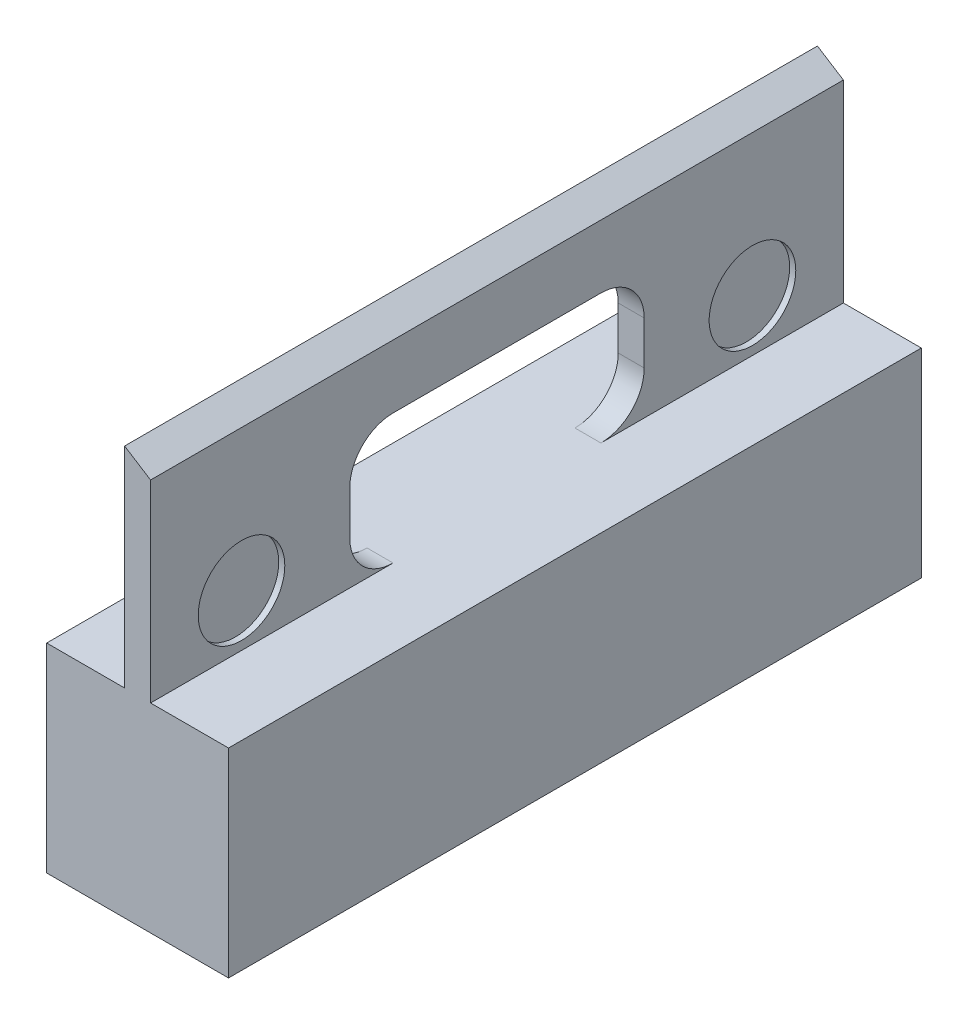
ISO-10303-21;
HEADER;
FILE_DESCRIPTION(('STEP AP214'),'2;1');
FILE_NAME('part.step','',(''),(''),'','','');
FILE_SCHEMA(('AUTOMOTIVE_DESIGN { 1 0 10303 214 1 1 1 1 }'));
ENDSEC;
DATA;
#1=APPLICATION_CONTEXT('core data for automotive mechanical design processes');
#2=APPLICATION_PROTOCOL_DEFINITION('international standard','automotive_design',2000,#1);
#3=PRODUCT_CONTEXT('',#1,'mechanical');
#4=PRODUCT('Part','Part','',(#3));
#5=PRODUCT_RELATED_PRODUCT_CATEGORY('part','',(#4));
#6=PRODUCT_DEFINITION_FORMATION('','',#4);
#7=PRODUCT_DEFINITION_CONTEXT('part definition',#1,'design');
#8=PRODUCT_DEFINITION('design','',#6,#7);
#9=PRODUCT_DEFINITION_SHAPE('','',#8);
#10=(LENGTH_UNIT() NAMED_UNIT(*) SI_UNIT(.MILLI.,.METRE.));
#11=(NAMED_UNIT(*) PLANE_ANGLE_UNIT() SI_UNIT($,.RADIAN.));
#12=(NAMED_UNIT(*) SI_UNIT($,.STERADIAN.) SOLID_ANGLE_UNIT());
#13=UNCERTAINTY_MEASURE_WITH_UNIT(LENGTH_MEASURE(1.E-05),#10,'distance_accuracy_value','');
#14=(GEOMETRIC_REPRESENTATION_CONTEXT(3) GLOBAL_UNCERTAINTY_ASSIGNED_CONTEXT((#13)) GLOBAL_UNIT_ASSIGNED_CONTEXT((#10,
#11,#12)) REPRESENTATION_CONTEXT('',''));
#15=CARTESIAN_POINT('',(0.,0.,0.));
#16=DIRECTION('',(0.,0.,1.));
#17=DIRECTION('',(1.,0.,0.));
#18=AXIS2_PLACEMENT_3D('',#15,#16,#17);
#19=CARTESIAN_POINT('',(0.,-21.,0.));
#20=DIRECTION('',(0.,-1.,0.));
#21=DIRECTION('',(0.,0.,-1.));
#22=AXIS2_PLACEMENT_3D('',#19,#20,#21);
#23=PLANE('',#22);
#24=DIRECTION('',(-1.,0.,0.));
#25=VECTOR('',#24,1.);
#26=CARTESIAN_POINT('',(-19.,-21.,48.));
#27=LINE('',#26,#25);
#28=CARTESIAN_POINT('',(-19.,-21.,48.));
#29=VERTEX_POINT('',#28);
#30=CARTESIAN_POINT('',(-21.,-21.,48.));
#31=VERTEX_POINT('',#30);
#32=EDGE_CURVE('E229',#29,#31,#27,.T.);
#33=ORIENTED_EDGE('',*,*,#32,.F.);
#34=DIRECTION('',(0.,0.,1.));
#35=VECTOR('',#34,1.);
#36=CARTESIAN_POINT('',(-19.,-21.,0.));
#37=LINE('',#36,#35);
#38=CARTESIAN_POINT('',(-19.,-21.,78.));
#39=VERTEX_POINT('',#38);
#40=EDGE_CURVE('E216',#29,#39,#37,.T.);
#41=ORIENTED_EDGE('',*,*,#40,.T.);
#42=DIRECTION('',(1.,0.,0.));
#43=VECTOR('',#42,1.);
#44=CARTESIAN_POINT('',(0.,-21.,78.));
#45=LINE('',#44,#43);
#46=CARTESIAN_POINT('',(-1.99999999999999,-21.,78.));
#47=VERTEX_POINT('',#46);
#48=EDGE_CURVE('E249',#39,#47,#45,.T.);
#49=ORIENTED_EDGE('',*,*,#48,.T.);
#50=DIRECTION('',(0.,0.,-1.));
#51=VECTOR('',#50,1.);
#52=CARTESIAN_POINT('',(-2.,-21.,0.));
#53=LINE('',#52,#51);
#54=CARTESIAN_POINT('',(-2.,-21.,2.));
#55=VERTEX_POINT('',#54);
#56=EDGE_CURVE('E242',#47,#55,#53,.T.);
#57=ORIENTED_EDGE('',*,*,#56,.T.);
#58=DIRECTION('',(-1.,0.,0.));
#59=VECTOR('',#58,1.);
#60=CARTESIAN_POINT('',(0.,-21.,2.));
#61=LINE('',#60,#59);
#62=CARTESIAN_POINT('',(-19.,-21.,2.));
#63=VERTEX_POINT('',#62);
#64=EDGE_CURVE('E259',#55,#63,#61,.T.);
#65=ORIENTED_EDGE('',*,*,#64,.T.);
#66=CARTESIAN_POINT('',(-19.,-21.,32.));
#67=VERTEX_POINT('',#66);
#68=EDGE_CURVE('E58',#63,#67,#37,.T.);
#69=ORIENTED_EDGE('',*,*,#68,.T.);
#70=DIRECTION('',(-1.,0.,0.));
#71=VECTOR('',#70,1.);
#72=CARTESIAN_POINT('',(-19.,-21.,32.));
#73=LINE('',#72,#71);
#74=CARTESIAN_POINT('',(-21.,-21.,32.));
#75=VERTEX_POINT('',#74);
#76=EDGE_CURVE('E232',#67,#75,#73,.T.);
#77=ORIENTED_EDGE('',*,*,#76,.T.);
#78=DIRECTION('',(0.,0.,1.));
#79=VECTOR('',#78,1.);
#80=CARTESIAN_POINT('',(-21.,-21.,0.));
#81=LINE('',#80,#79);
#82=CARTESIAN_POINT('',(-21.,-21.,0.));
#83=VERTEX_POINT('',#82);
#84=EDGE_CURVE('E328',#83,#75,#81,.T.);
#85=ORIENTED_EDGE('',*,*,#84,.F.);
#86=DIRECTION('',(-1.,0.,0.));
#87=VECTOR('',#86,1.);
#88=CARTESIAN_POINT('',(0.,-21.,0.));
#89=LINE('',#88,#87);
#90=CARTESIAN_POINT('',(0.,-21.,0.));
#91=VERTEX_POINT('',#90);
#92=EDGE_CURVE('E324',#91,#83,#89,.T.);
#93=ORIENTED_EDGE('',*,*,#92,.F.);
#94=DIRECTION('',(0.,0.,-1.));
#95=VECTOR('',#94,1.);
#96=CARTESIAN_POINT('',(0.,-21.,0.));
#97=LINE('',#96,#95);
#98=CARTESIAN_POINT('',(0.,-21.,80.));
#99=VERTEX_POINT('',#98);
#100=EDGE_CURVE('E321',#99,#91,#97,.T.);
#101=ORIENTED_EDGE('',*,*,#100,.F.);
#102=DIRECTION('',(1.,0.,0.));
#103=VECTOR('',#102,1.);
#104=CARTESIAN_POINT('',(0.,-21.,80.));
#105=LINE('',#104,#103);
#106=CARTESIAN_POINT('',(-21.,-21.,80.));
#107=VERTEX_POINT('',#106);
#108=EDGE_CURVE('E331',#107,#99,#105,.T.);
#109=ORIENTED_EDGE('',*,*,#108,.F.);
#110=EDGE_CURVE('E327',#31,#107,#81,.T.);
#111=ORIENTED_EDGE('',*,*,#110,.F.);
#112=EDGE_LOOP('',(#33,#41,#49,#57,#65,#69,#77,#85,#93,#101,#109,#111));
#113=FACE_BOUND('',#112,.T.);
#114=ADVANCED_FACE('F36',(#113),#23,.T.);
#115=CARTESIAN_POINT('',(0.,2.,0.));
#116=DIRECTION('',(0.,-1.,0.));
#117=DIRECTION('',(0.,0.,-1.));
#118=AXIS2_PLACEMENT_3D('',#115,#116,#117);
#119=PLANE('',#118);
#120=DIRECTION('',(-1.,0.,0.));
#121=VECTOR('',#120,1.);
#122=CARTESIAN_POINT('',(-12.,2.,28.));
#123=LINE('',#122,#121);
#124=CARTESIAN_POINT('',(-8.99999999999999,2.,28.));
#125=VERTEX_POINT('',#124);
#126=CARTESIAN_POINT('',(-12.,2.,28.));
#127=VERTEX_POINT('',#126);
#128=EDGE_CURVE('E347',#125,#127,#123,.T.);
#129=ORIENTED_EDGE('',*,*,#128,.T.);
#130=DIRECTION('',(0.,0.,1.));
#131=VECTOR('',#130,1.);
#132=CARTESIAN_POINT('',(-12.,2.,0.));
#133=LINE('',#132,#131);
#134=CARTESIAN_POINT('',(-12.,2.,0.));
#135=VERTEX_POINT('',#134);
#136=EDGE_CURVE('E293',#135,#127,#133,.T.);
#137=ORIENTED_EDGE('',*,*,#136,.F.);
#138=DIRECTION('',(-1.,0.,0.));
#139=VECTOR('',#138,1.);
#140=CARTESIAN_POINT('',(0.,2.,0.));
#141=LINE('',#140,#139);
#142=CARTESIAN_POINT('',(-21.,2.,0.));
#143=VERTEX_POINT('',#142);
#144=EDGE_CURVE('E310',#135,#143,#141,.T.);
#145=ORIENTED_EDGE('',*,*,#144,.T.);
#146=DIRECTION('',(0.,0.,1.));
#147=VECTOR('',#146,1.);
#148=CARTESIAN_POINT('',(-21.,2.,0.));
#149=LINE('',#148,#147);
#150=CARTESIAN_POINT('',(-21.,2.,80.));
#151=VERTEX_POINT('',#150);
#152=EDGE_CURVE('E314',#143,#151,#149,.T.);
#153=ORIENTED_EDGE('',*,*,#152,.T.);
#154=DIRECTION('',(1.,0.,0.));
#155=VECTOR('',#154,1.);
#156=CARTESIAN_POINT('',(0.,2.,80.));
#157=LINE('',#156,#155);
#158=CARTESIAN_POINT('',(-12.,2.,80.));
#159=VERTEX_POINT('',#158);
#160=EDGE_CURVE('E318',#151,#159,#157,.T.);
#161=ORIENTED_EDGE('',*,*,#160,.T.);
#162=CARTESIAN_POINT('',(-12.,2.,52.));
#163=VERTEX_POINT('',#162);
#164=EDGE_CURVE('E296',#163,#159,#133,.T.);
#165=ORIENTED_EDGE('',*,*,#164,.F.);
#166=DIRECTION('',(-1.,0.,0.));
#167=VECTOR('',#166,1.);
#168=CARTESIAN_POINT('',(-8.99999999999999,2.,52.));
#169=LINE('',#168,#167);
#170=CARTESIAN_POINT('',(-8.99999999999998,2.,52.));
#171=VERTEX_POINT('',#170);
#172=EDGE_CURVE('E338',#163,#171,#169,.F.);
#173=ORIENTED_EDGE('',*,*,#172,.T.);
#174=DIRECTION('',(0.,0.,-1.));
#175=VECTOR('',#174,1.);
#176=CARTESIAN_POINT('',(-8.99999999999999,2.,0.));
#177=LINE('',#176,#175);
#178=CARTESIAN_POINT('',(-8.99999999999998,2.,80.));
#179=VERTEX_POINT('',#178);
#180=EDGE_CURVE('E294',#179,#171,#177,.T.);
#181=ORIENTED_EDGE('',*,*,#180,.F.);
#182=CARTESIAN_POINT('',(0.,2.,80.));
#183=VERTEX_POINT('',#182);
#184=EDGE_CURVE('E317',#179,#183,#157,.T.);
#185=ORIENTED_EDGE('',*,*,#184,.T.);
#186=DIRECTION('',(0.,0.,-1.));
#187=VECTOR('',#186,1.);
#188=CARTESIAN_POINT('',(0.,2.,0.));
#189=LINE('',#188,#187);
#190=CARTESIAN_POINT('',(0.,2.,0.));
#191=VERTEX_POINT('',#190);
#192=EDGE_CURVE('E307',#183,#191,#189,.T.);
#193=ORIENTED_EDGE('',*,*,#192,.T.);
#194=CARTESIAN_POINT('',(-8.99999999999998,2.,0.));
#195=VERTEX_POINT('',#194);
#196=EDGE_CURVE('E311',#191,#195,#141,.T.);
#197=ORIENTED_EDGE('',*,*,#196,.T.);
#198=EDGE_CURVE('E282',#125,#195,#177,.T.);
#199=ORIENTED_EDGE('',*,*,#198,.F.);
#200=EDGE_LOOP('',(#129,#137,#145,#153,#161,#165,#173,#181,#185,#193,#197,#199));
#201=FACE_BOUND('',#200,.T.);
#202=ADVANCED_FACE('F389',(#201),#119,.F.);
#203=CARTESIAN_POINT('',(0.,-21.,0.));
#204=DIRECTION('',(1.,0.,0.));
#205=DIRECTION('',(0.,0.,-1.));
#206=AXIS2_PLACEMENT_3D('',#203,#204,#205);
#207=PLANE('',#206);
#208=DIRECTION('',(0.,1.,0.));
#209=VECTOR('',#208,1.);
#210=CARTESIAN_POINT('',(0.,-21.,0.));
#211=LINE('',#210,#209);
#212=EDGE_CURVE('E334',#91,#191,#211,.T.);
#213=ORIENTED_EDGE('',*,*,#212,.T.);
#214=ORIENTED_EDGE('',*,*,#192,.F.);
#215=DIRECTION('',(0.,1.,0.));
#216=VECTOR('',#215,1.);
#217=CARTESIAN_POINT('',(0.,-21.,80.));
#218=LINE('',#217,#216);
#219=EDGE_CURVE('E335',#99,#183,#218,.T.);
#220=ORIENTED_EDGE('',*,*,#219,.F.);
#221=ORIENTED_EDGE('',*,*,#100,.T.);
#222=EDGE_LOOP('',(#213,#214,#220,#221));
#223=FACE_BOUND('',#222,.T.);
#224=ADVANCED_FACE('F439',(#223),#207,.T.);
#225=CARTESIAN_POINT('',(0.,-21.,80.));
#226=DIRECTION('',(0.,0.,1.));
#227=DIRECTION('',(1.,0.,0.));
#228=AXIS2_PLACEMENT_3D('',#225,#226,#227);
#229=PLANE('',#228);
#230=DIRECTION('',(0.844819075554229,-0.535052081184344,0.));
#231=VECTOR('',#230,1.);
#232=CARTESIAN_POINT('',(-8.99999999999998,24.3,80.));
#233=LINE('',#232,#231);
#234=CARTESIAN_POINT('',(-12.,26.2,80.));
#235=VERTEX_POINT('',#234);
#236=CARTESIAN_POINT('',(-8.99999999999998,24.3,80.));
#237=VERTEX_POINT('',#236);
#238=EDGE_CURVE('E253',#235,#237,#233,.T.);
#239=ORIENTED_EDGE('',*,*,#238,.F.);
#240=DIRECTION('',(0.,-1.,0.));
#241=VECTOR('',#240,1.);
#242=CARTESIAN_POINT('',(-12.,26.2,80.));
#243=LINE('',#242,#241);
#244=EDGE_CURVE('E299',#235,#159,#243,.T.);
#245=ORIENTED_EDGE('',*,*,#244,.T.);
#246=ORIENTED_EDGE('',*,*,#160,.F.);
#247=DIRECTION('',(0.,1.,0.));
#248=VECTOR('',#247,1.);
#249=CARTESIAN_POINT('',(-21.,-21.,80.));
#250=LINE('',#249,#248);
#251=EDGE_CURVE('E339',#107,#151,#250,.T.);
#252=ORIENTED_EDGE('',*,*,#251,.F.);
#253=ORIENTED_EDGE('',*,*,#108,.T.);
#254=ORIENTED_EDGE('',*,*,#219,.T.);
#255=ORIENTED_EDGE('',*,*,#184,.F.);
#256=DIRECTION('',(0.,-1.,0.));
#257=VECTOR('',#256,1.);
#258=CARTESIAN_POINT('',(-8.99999999999998,26.2,80.));
#259=LINE('',#258,#257);
#260=EDGE_CURVE('E292',#237,#179,#259,.T.);
#261=ORIENTED_EDGE('',*,*,#260,.F.);
#262=EDGE_LOOP('',(#239,#245,#246,#252,#253,#254,#255,#261));
#263=FACE_BOUND('',#262,.T.);
#264=ADVANCED_FACE('F396',(#263),#229,.T.);
#265=CARTESIAN_POINT('',(-21.,-21.,0.));
#266=DIRECTION('',(-1.,0.,0.));
#267=DIRECTION('',(0.,0.,1.));
#268=AXIS2_PLACEMENT_3D('',#265,#266,#267);
#269=PLANE('',#268);
#270=DIRECTION('',(0.,1.,0.));
#271=VECTOR('',#270,1.);
#272=CARTESIAN_POINT('',(-21.,-21.,48.));
#273=LINE('',#272,#271);
#274=CARTESIAN_POINT('',(-21.,-11.,48.));
#275=VERTEX_POINT('',#274);
#276=EDGE_CURVE('E203',#31,#275,#273,.T.);
#277=ORIENTED_EDGE('',*,*,#276,.F.);
#278=ORIENTED_EDGE('',*,*,#110,.T.);
#279=ORIENTED_EDGE('',*,*,#251,.T.);
#280=ORIENTED_EDGE('',*,*,#152,.F.);
#281=DIRECTION('',(0.,1.,0.));
#282=VECTOR('',#281,1.);
#283=CARTESIAN_POINT('',(-21.,-21.,0.));
#284=LINE('',#283,#282);
#285=EDGE_CURVE('E341',#83,#143,#284,.T.);
#286=ORIENTED_EDGE('',*,*,#285,.F.);
#287=ORIENTED_EDGE('',*,*,#84,.T.);
#288=DIRECTION('',(0.,-1.,0.));
#289=VECTOR('',#288,1.);
#290=CARTESIAN_POINT('',(-21.,-21.,32.));
#291=LINE('',#290,#289);
#292=CARTESIAN_POINT('',(-21.,-11.,32.));
#293=VERTEX_POINT('',#292);
#294=EDGE_CURVE('E217',#293,#75,#291,.T.);
#295=ORIENTED_EDGE('',*,*,#294,.F.);
#296=DIRECTION('',(0.,0.,-1.));
#297=VECTOR('',#296,1.);
#298=CARTESIAN_POINT('',(-21.,-11.,48.));
#299=LINE('',#298,#297);
#300=EDGE_CURVE('E219',#275,#293,#299,.T.);
#301=ORIENTED_EDGE('',*,*,#300,.F.);
#302=EDGE_LOOP('',(#277,#278,#279,#280,#286,#287,#295,#301));
#303=FACE_BOUND('',#302,.T.);
#304=ADVANCED_FACE('F447',(#303),#269,.T.);
#305=CARTESIAN_POINT('',(0.,-21.,0.));
#306=DIRECTION('',(0.,0.,-1.));
#307=DIRECTION('',(-1.,0.,0.));
#308=AXIS2_PLACEMENT_3D('',#305,#306,#307);
#309=PLANE('',#308);
#310=DIRECTION('',(-0.844819075554229,0.535052081184344,0.));
#311=VECTOR('',#310,1.);
#312=CARTESIAN_POINT('',(17.9000793021412,7.26328310864396,0.));
#313=LINE('',#312,#311);
#314=CARTESIAN_POINT('',(-8.99999999999998,24.3,0.));
#315=VERTEX_POINT('',#314);
#316=CARTESIAN_POINT('',(-12.,26.2,0.));
#317=VERTEX_POINT('',#316);
#318=EDGE_CURVE('E269',#315,#317,#313,.T.);
#319=ORIENTED_EDGE('',*,*,#318,.F.);
#320=DIRECTION('',(0.,-1.,0.));
#321=VECTOR('',#320,1.);
#322=CARTESIAN_POINT('',(-8.99999999999999,26.2,0.));
#323=LINE('',#322,#321);
#324=EDGE_CURVE('E305',#315,#195,#323,.T.);
#325=ORIENTED_EDGE('',*,*,#324,.T.);
#326=ORIENTED_EDGE('',*,*,#196,.F.);
#327=ORIENTED_EDGE('',*,*,#212,.F.);
#328=ORIENTED_EDGE('',*,*,#92,.T.);
#329=ORIENTED_EDGE('',*,*,#285,.T.);
#330=ORIENTED_EDGE('',*,*,#144,.F.);
#331=DIRECTION('',(0.,-1.,0.));
#332=VECTOR('',#331,1.);
#333=CARTESIAN_POINT('',(-12.,26.2,0.));
#334=LINE('',#333,#332);
#335=EDGE_CURVE('E302',#317,#135,#334,.T.);
#336=ORIENTED_EDGE('',*,*,#335,.F.);
#337=EDGE_LOOP('',(#319,#325,#326,#327,#328,#329,#330,#336));
#338=FACE_BOUND('',#337,.T.);
#339=ADVANCED_FACE('F406',(#338),#309,.T.);
#340=CARTESIAN_POINT('',(-8.99999999999999,26.2,0.));
#341=DIRECTION('',(-1.,0.,0.));
#342=DIRECTION('',(0.,0.,1.));
#343=AXIS2_PLACEMENT_3D('',#340,#341,#342);
#344=PLANE('',#343);
#345=CARTESIAN_POINT('',(-8.99999999999998,8.,69.5));
#346=DIRECTION('',(1.,0.,0.));
#347=DIRECTION('',(0.,0.,-1.));
#348=AXIS2_PLACEMENT_3D('',#345,#346,#347);
#349=CIRCLE('',#348,5.);
#350=CARTESIAN_POINT('',(-8.99999999999998,8.,64.5));
#351=VERTEX_POINT('',#350);
#352=EDGE_CURVE('E758',#351,#351,#349,.T.);
#353=ORIENTED_EDGE('',*,*,#352,.F.);
#354=EDGE_LOOP('',(#353));
#355=FACE_BOUND('',#354,.T.);
#356=CARTESIAN_POINT('',(-8.99999999999999,8.,10.5));
#357=DIRECTION('',(1.,0.,0.));
#358=DIRECTION('',(0.,0.,-1.));
#359=AXIS2_PLACEMENT_3D('',#356,#357,#358);
#360=CIRCLE('',#359,5.);
#361=CARTESIAN_POINT('',(-8.99999999999999,8.,5.5));
#362=VERTEX_POINT('',#361);
#363=EDGE_CURVE('E222',#362,#362,#360,.T.);
#364=ORIENTED_EDGE('',*,*,#363,.F.);
#365=EDGE_LOOP('',(#364));
#366=FACE_BOUND('',#365,.T.);
#367=ORIENTED_EDGE('',*,*,#324,.F.);
#368=DIRECTION('',(0.,0.,1.));
#369=VECTOR('',#368,1.);
#370=CARTESIAN_POINT('',(-8.99999999999998,24.3,-1.00000000000004));
#371=LINE('',#370,#369);
#372=EDGE_CURVE('E266',#315,#237,#371,.T.);
#373=ORIENTED_EDGE('',*,*,#372,.T.);
#374=ORIENTED_EDGE('',*,*,#260,.T.);
#375=ORIENTED_EDGE('',*,*,#180,.T.);
#376=CARTESIAN_POINT('',(-8.99999999999998,7.,52.));
#377=DIRECTION('',(-1.,0.,0.));
#378=DIRECTION('',(0.,0.,1.));
#379=AXIS2_PLACEMENT_3D('',#376,#377,#378);
#380=CIRCLE('',#379,5.);
#381=CARTESIAN_POINT('',(-8.99999999999999,7.,57.));
#382=VERTEX_POINT('',#381);
#383=EDGE_CURVE('E11',#171,#382,#380,.T.);
#384=ORIENTED_EDGE('',*,*,#383,.T.);
#385=DIRECTION('',(0.,1.,0.));
#386=VECTOR('',#385,1.);
#387=CARTESIAN_POINT('',(-8.99999999999999,2.,57.));
#388=LINE('',#387,#386);
#389=CARTESIAN_POINT('',(-8.99999999999999,12.,57.));
#390=VERTEX_POINT('',#389);
#391=EDGE_CURVE('E272',#382,#390,#388,.T.);
#392=ORIENTED_EDGE('',*,*,#391,.T.);
#393=CARTESIAN_POINT('',(-8.99999999999998,12.,52.));
#394=DIRECTION('',(-1.,0.,0.));
#395=DIRECTION('',(0.,0.,1.));
#396=AXIS2_PLACEMENT_3D('',#393,#394,#395);
#397=CIRCLE('',#396,5.);
#398=CARTESIAN_POINT('',(-8.99999999999999,17.,52.));
#399=VERTEX_POINT('',#398);
#400=EDGE_CURVE('E376',#390,#399,#397,.T.);
#401=ORIENTED_EDGE('',*,*,#400,.T.);
#402=DIRECTION('',(0.,0.,-1.));
#403=VECTOR('',#402,1.);
#404=CARTESIAN_POINT('',(-8.99999999999999,17.,57.));
#405=LINE('',#404,#403);
#406=CARTESIAN_POINT('',(-8.99999999999999,17.,28.));
#407=VERTEX_POINT('',#406);
#408=EDGE_CURVE('E275',#399,#407,#405,.T.);
#409=ORIENTED_EDGE('',*,*,#408,.T.);
#410=CARTESIAN_POINT('',(-8.99999999999999,12.,28.));
#411=DIRECTION('',(-1.,0.,0.));
#412=DIRECTION('',(0.,0.,1.));
#413=AXIS2_PLACEMENT_3D('',#410,#411,#412);
#414=CIRCLE('',#413,5.);
#415=CARTESIAN_POINT('',(-8.99999999999999,12.,23.));
#416=VERTEX_POINT('',#415);
#417=EDGE_CURVE('E372',#407,#416,#414,.T.);
#418=ORIENTED_EDGE('',*,*,#417,.T.);
#419=DIRECTION('',(0.,-1.,0.));
#420=VECTOR('',#419,1.);
#421=CARTESIAN_POINT('',(-8.99999999999999,2.,23.));
#422=LINE('',#421,#420);
#423=CARTESIAN_POINT('',(-8.99999999999999,7.,23.));
#424=VERTEX_POINT('',#423);
#425=EDGE_CURVE('E279',#416,#424,#422,.T.);
#426=ORIENTED_EDGE('',*,*,#425,.T.);
#427=CARTESIAN_POINT('',(-8.99999999999999,7.,28.));
#428=DIRECTION('',(-1.,0.,0.));
#429=DIRECTION('',(0.,0.,1.));
#430=AXIS2_PLACEMENT_3D('',#427,#428,#429);
#431=CIRCLE('',#430,5.);
#432=EDGE_CURVE('E367',#424,#125,#431,.T.);
#433=ORIENTED_EDGE('',*,*,#432,.T.);
#434=ORIENTED_EDGE('',*,*,#198,.T.);
#435=EDGE_LOOP('',(#367,#373,#374,#375,#384,#392,#401,#409,#418,#426,#433,#434));
#436=FACE_BOUND('',#435,.T.);
#437=ADVANCED_FACE('F419',(#355,#366,#436),#344,.F.);
#438=CARTESIAN_POINT('',(-12.,26.2,0.));
#439=DIRECTION('',(1.,0.,0.));
#440=DIRECTION('',(0.,0.,-1.));
#441=AXIS2_PLACEMENT_3D('',#438,#439,#440);
#442=PLANE('',#441);
#443=DIRECTION('',(0.,0.,-1.));
#444=VECTOR('',#443,1.);
#445=CARTESIAN_POINT('',(-12.,17.,57.));
#446=LINE('',#445,#444);
#447=CARTESIAN_POINT('',(-12.,17.,52.));
#448=VERTEX_POINT('',#447);
#449=CARTESIAN_POINT('',(-12.,17.,28.));
#450=VERTEX_POINT('',#449);
#451=EDGE_CURVE('E285',#448,#450,#446,.T.);
#452=ORIENTED_EDGE('',*,*,#451,.F.);
#453=CARTESIAN_POINT('',(-12.,12.,52.));
#454=DIRECTION('',(1.,0.,0.));
#455=DIRECTION('',(0.,0.,-1.));
#456=AXIS2_PLACEMENT_3D('',#453,#454,#455);
#457=CIRCLE('',#456,5.);
#458=CARTESIAN_POINT('',(-12.,12.,57.));
#459=VERTEX_POINT('',#458);
#460=EDGE_CURVE('E374',#448,#459,#457,.T.);
#461=ORIENTED_EDGE('',*,*,#460,.T.);
#462=DIRECTION('',(0.,1.,0.));
#463=VECTOR('',#462,1.);
#464=CARTESIAN_POINT('',(-12.,2.,57.));
#465=LINE('',#464,#463);
#466=CARTESIAN_POINT('',(-12.,7.,57.));
#467=VERTEX_POINT('',#466);
#468=EDGE_CURVE('E271',#467,#459,#465,.T.);
#469=ORIENTED_EDGE('',*,*,#468,.F.);
#470=CARTESIAN_POINT('',(-12.,7.,52.));
#471=DIRECTION('',(1.,0.,0.));
#472=DIRECTION('',(0.,0.,-1.));
#473=AXIS2_PLACEMENT_3D('',#470,#471,#472);
#474=CIRCLE('',#473,5.);
#475=EDGE_CURVE('E44',#467,#163,#474,.T.);
#476=ORIENTED_EDGE('',*,*,#475,.T.);
#477=ORIENTED_EDGE('',*,*,#164,.T.);
#478=ORIENTED_EDGE('',*,*,#244,.F.);
#479=DIRECTION('',(0.,0.,1.));
#480=VECTOR('',#479,1.);
#481=CARTESIAN_POINT('',(-12.,26.2,0.));
#482=LINE('',#481,#480);
#483=EDGE_CURVE('E290',#317,#235,#482,.T.);
#484=ORIENTED_EDGE('',*,*,#483,.F.);
#485=ORIENTED_EDGE('',*,*,#335,.T.);
#486=ORIENTED_EDGE('',*,*,#136,.T.);
#487=CARTESIAN_POINT('',(-12.,7.,28.));
#488=DIRECTION('',(1.,0.,0.));
#489=DIRECTION('',(0.,0.,-1.));
#490=AXIS2_PLACEMENT_3D('',#487,#488,#489);
#491=CIRCLE('',#490,5.);
#492=CARTESIAN_POINT('',(-12.,7.,23.));
#493=VERTEX_POINT('',#492);
#494=EDGE_CURVE('E365',#127,#493,#491,.T.);
#495=ORIENTED_EDGE('',*,*,#494,.T.);
#496=DIRECTION('',(0.,-1.,0.));
#497=VECTOR('',#496,1.);
#498=CARTESIAN_POINT('',(-12.,2.,23.));
#499=LINE('',#498,#497);
#500=CARTESIAN_POINT('',(-12.,12.,23.));
#501=VERTEX_POINT('',#500);
#502=EDGE_CURVE('E276',#501,#493,#499,.T.);
#503=ORIENTED_EDGE('',*,*,#502,.F.);
#504=CARTESIAN_POINT('',(-12.,12.,28.));
#505=DIRECTION('',(1.,0.,0.));
#506=DIRECTION('',(0.,0.,-1.));
#507=AXIS2_PLACEMENT_3D('',#504,#505,#506);
#508=CIRCLE('',#507,5.);
#509=EDGE_CURVE('E370',#501,#450,#508,.T.);
#510=ORIENTED_EDGE('',*,*,#509,.T.);
#511=EDGE_LOOP('',(#452,#461,#469,#476,#477,#478,#484,#485,#486,#495,#503,#510));
#512=FACE_BOUND('',#511,.T.);
#513=ADVANCED_FACE('F382',(#512),#442,.F.);
#514=CARTESIAN_POINT('',(-8.99999999999999,2.,57.));
#515=DIRECTION('',(0.,0.,1.));
#516=DIRECTION('',(1.,0.,0.));
#517=AXIS2_PLACEMENT_3D('',#514,#515,#516);
#518=PLANE('',#517);
#519=ORIENTED_EDGE('',*,*,#468,.T.);
#520=DIRECTION('',(-1.,0.,0.));
#521=VECTOR('',#520,1.);
#522=CARTESIAN_POINT('',(-8.99999999999999,12.,57.));
#523=LINE('',#522,#521);
#524=EDGE_CURVE('E363',#459,#390,#523,.F.);
#525=ORIENTED_EDGE('',*,*,#524,.T.);
#526=ORIENTED_EDGE('',*,*,#391,.F.);
#527=DIRECTION('',(-1.,0.,0.));
#528=VECTOR('',#527,1.);
#529=CARTESIAN_POINT('',(-12.,7.,57.));
#530=LINE('',#529,#528);
#531=EDGE_CURVE('E360',#382,#467,#530,.T.);
#532=ORIENTED_EDGE('',*,*,#531,.T.);
#533=EDGE_LOOP('',(#519,#525,#526,#532));
#534=FACE_BOUND('',#533,.T.);
#535=ADVANCED_FACE('F434',(#534),#518,.F.);
#536=CARTESIAN_POINT('',(-8.99999999999999,2.,23.));
#537=DIRECTION('',(0.,0.,-1.));
#538=DIRECTION('',(-1.,0.,0.));
#539=AXIS2_PLACEMENT_3D('',#536,#537,#538);
#540=PLANE('',#539);
#541=ORIENTED_EDGE('',*,*,#502,.T.);
#542=DIRECTION('',(-1.,0.,0.));
#543=VECTOR('',#542,1.);
#544=CARTESIAN_POINT('',(-8.99999999999999,7.,23.));
#545=LINE('',#544,#543);
#546=EDGE_CURVE('E353',#493,#424,#545,.F.);
#547=ORIENTED_EDGE('',*,*,#546,.T.);
#548=ORIENTED_EDGE('',*,*,#425,.F.);
#549=DIRECTION('',(-1.,0.,0.));
#550=VECTOR('',#549,1.);
#551=CARTESIAN_POINT('',(-12.,12.,23.));
#552=LINE('',#551,#550);
#553=EDGE_CURVE('E350',#416,#501,#552,.T.);
#554=ORIENTED_EDGE('',*,*,#553,.T.);
#555=EDGE_LOOP('',(#541,#547,#548,#554));
#556=FACE_BOUND('',#555,.T.);
#557=ADVANCED_FACE('F416',(#556),#540,.F.);
#558=CARTESIAN_POINT('',(-8.99999999999999,17.,57.));
#559=DIRECTION('',(0.,1.,0.));
#560=DIRECTION('',(0.,0.,1.));
#561=AXIS2_PLACEMENT_3D('',#558,#559,#560);
#562=PLANE('',#561);
#563=ORIENTED_EDGE('',*,*,#451,.T.);
#564=DIRECTION('',(-1.,0.,0.));
#565=VECTOR('',#564,1.);
#566=CARTESIAN_POINT('',(-8.99999999999999,17.,28.));
#567=LINE('',#566,#565);
#568=EDGE_CURVE('E358',#450,#407,#567,.F.);
#569=ORIENTED_EDGE('',*,*,#568,.T.);
#570=ORIENTED_EDGE('',*,*,#408,.F.);
#571=DIRECTION('',(-1.,0.,0.));
#572=VECTOR('',#571,1.);
#573=CARTESIAN_POINT('',(-12.,17.,52.));
#574=LINE('',#573,#572);
#575=EDGE_CURVE('E355',#399,#448,#574,.T.);
#576=ORIENTED_EDGE('',*,*,#575,.T.);
#577=EDGE_LOOP('',(#563,#569,#570,#576));
#578=FACE_BOUND('',#577,.T.);
#579=ADVANCED_FACE('F427',(#578),#562,.F.);
#580=CARTESIAN_POINT('',(0.,7.,28.));
#581=DIRECTION('',(1.,0.,0.));
#582=DIRECTION('',(0.,0.,-1.));
#583=AXIS2_PLACEMENT_3D('',#580,#581,#582);
#584=CYLINDRICAL_SURFACE('',#583,5.);
#585=ORIENTED_EDGE('',*,*,#432,.F.);
#586=ORIENTED_EDGE('',*,*,#546,.F.);
#587=ORIENTED_EDGE('',*,*,#494,.F.);
#588=ORIENTED_EDGE('',*,*,#128,.F.);
#589=EDGE_LOOP('',(#585,#586,#587,#588));
#590=FACE_BOUND('',#589,.T.);
#591=ADVANCED_FACE('F413',(#590),#584,.F.);
#592=CARTESIAN_POINT('',(-8.99999999999999,12.,28.));
#593=DIRECTION('',(1.,0.,0.));
#594=DIRECTION('',(0.,0.,-1.));
#595=AXIS2_PLACEMENT_3D('',#592,#593,#594);
#596=CYLINDRICAL_SURFACE('',#595,5.);
#597=ORIENTED_EDGE('',*,*,#417,.F.);
#598=ORIENTED_EDGE('',*,*,#568,.F.);
#599=ORIENTED_EDGE('',*,*,#509,.F.);
#600=ORIENTED_EDGE('',*,*,#553,.F.);
#601=EDGE_LOOP('',(#597,#598,#599,#600));
#602=FACE_BOUND('',#601,.T.);
#603=ADVANCED_FACE('F425',(#602),#596,.F.);
#604=CARTESIAN_POINT('',(-8.99999999999999,12.,52.));
#605=DIRECTION('',(1.,0.,0.));
#606=DIRECTION('',(0.,0.,-1.));
#607=AXIS2_PLACEMENT_3D('',#604,#605,#606);
#608=CYLINDRICAL_SURFACE('',#607,5.);
#609=ORIENTED_EDGE('',*,*,#400,.F.);
#610=ORIENTED_EDGE('',*,*,#524,.F.);
#611=ORIENTED_EDGE('',*,*,#460,.F.);
#612=ORIENTED_EDGE('',*,*,#575,.F.);
#613=EDGE_LOOP('',(#609,#610,#611,#612));
#614=FACE_BOUND('',#613,.T.);
#615=ADVANCED_FACE('F431',(#614),#608,.F.);
#616=CARTESIAN_POINT('',(-8.99999999999999,7.,52.));
#617=DIRECTION('',(1.,0.,0.));
#618=DIRECTION('',(0.,0.,-1.));
#619=AXIS2_PLACEMENT_3D('',#616,#617,#618);
#620=CYLINDRICAL_SURFACE('',#619,5.);
#621=ORIENTED_EDGE('',*,*,#383,.F.);
#622=ORIENTED_EDGE('',*,*,#172,.F.);
#623=ORIENTED_EDGE('',*,*,#475,.F.);
#624=ORIENTED_EDGE('',*,*,#531,.F.);
#625=EDGE_LOOP('',(#621,#622,#623,#624));
#626=FACE_BOUND('',#625,.T.);
#627=ADVANCED_FACE('F38',(#626),#620,.F.);
#628=CARTESIAN_POINT('',(-8.99999999999998,24.3,-1.00000000000004));
#629=DIRECTION('',(-0.535052081184344,-0.844819075554229,0.));
#630=DIRECTION('',(0.844819075554229,-0.535052081184344,0.));
#631=AXIS2_PLACEMENT_3D('',#628,#629,#630);
#632=PLANE('',#631);
#633=ORIENTED_EDGE('',*,*,#318,.T.);
#634=ORIENTED_EDGE('',*,*,#483,.T.);
#635=ORIENTED_EDGE('',*,*,#238,.T.);
#636=ORIENTED_EDGE('',*,*,#372,.F.);
#637=EDGE_LOOP('',(#633,#634,#635,#636));
#638=FACE_BOUND('',#637,.T.);
#639=ADVANCED_FACE('F401',(#638),#632,.F.);
#640=CARTESIAN_POINT('',(0.,0.,0.));
#641=DIRECTION('',(0.,-1.,0.));
#642=DIRECTION('',(0.,0.,-1.));
#643=AXIS2_PLACEMENT_3D('',#640,#641,#642);
#644=PLANE('',#643);
#645=DIRECTION('',(-1.,0.,0.));
#646=VECTOR('',#645,1.);
#647=CARTESIAN_POINT('',(0.,0.,2.));
#648=LINE('',#647,#646);
#649=CARTESIAN_POINT('',(-2.,0.,2.));
#650=VERTEX_POINT('',#649);
#651=CARTESIAN_POINT('',(-19.,0.,2.));
#652=VERTEX_POINT('',#651);
#653=EDGE_CURVE('E240',#650,#652,#648,.T.);
#654=ORIENTED_EDGE('',*,*,#653,.F.);
#655=DIRECTION('',(0.,0.,-1.));
#656=VECTOR('',#655,1.);
#657=CARTESIAN_POINT('',(-2.,0.,0.));
#658=LINE('',#657,#656);
#659=CARTESIAN_POINT('',(-1.99999999999999,0.,78.));
#660=VERTEX_POINT('',#659);
#661=EDGE_CURVE('E231',#660,#650,#658,.T.);
#662=ORIENTED_EDGE('',*,*,#661,.F.);
#663=DIRECTION('',(1.,0.,0.));
#664=VECTOR('',#663,1.);
#665=CARTESIAN_POINT('',(0.,0.,78.));
#666=LINE('',#665,#664);
#667=CARTESIAN_POINT('',(-19.,0.,78.));
#668=VERTEX_POINT('',#667);
#669=EDGE_CURVE('E239',#668,#660,#666,.T.);
#670=ORIENTED_EDGE('',*,*,#669,.F.);
#671=DIRECTION('',(0.,0.,1.));
#672=VECTOR('',#671,1.);
#673=CARTESIAN_POINT('',(-19.,0.,0.));
#674=LINE('',#673,#672);
#675=EDGE_CURVE('E236',#652,#668,#674,.T.);
#676=ORIENTED_EDGE('',*,*,#675,.F.);
#677=EDGE_LOOP('',(#654,#662,#670,#676));
#678=FACE_BOUND('',#677,.T.);
#679=ADVANCED_FACE('F463',(#678),#644,.T.);
#680=CARTESIAN_POINT('',(-2.,-21.,0.));
#681=DIRECTION('',(1.,0.,0.));
#682=DIRECTION('',(0.,0.,-1.));
#683=AXIS2_PLACEMENT_3D('',#680,#681,#682);
#684=PLANE('',#683);
#685=DIRECTION('',(0.,1.,0.));
#686=VECTOR('',#685,1.);
#687=CARTESIAN_POINT('',(-2.,-21.,2.));
#688=LINE('',#687,#686);
#689=EDGE_CURVE('E246',#55,#650,#688,.T.);
#690=ORIENTED_EDGE('',*,*,#689,.F.);
#691=ORIENTED_EDGE('',*,*,#56,.F.);
#692=DIRECTION('',(0.,1.,0.));
#693=VECTOR('',#692,1.);
#694=CARTESIAN_POINT('',(-1.99999999999999,-21.,78.));
#695=LINE('',#694,#693);
#696=EDGE_CURVE('E250',#47,#660,#695,.T.);
#697=ORIENTED_EDGE('',*,*,#696,.T.);
#698=ORIENTED_EDGE('',*,*,#661,.T.);
#699=EDGE_LOOP('',(#690,#691,#697,#698));
#700=FACE_BOUND('',#699,.T.);
#701=ADVANCED_FACE('F457',(#700),#684,.F.);
#702=CARTESIAN_POINT('',(0.,-21.,78.));
#703=DIRECTION('',(0.,0.,1.));
#704=DIRECTION('',(1.,0.,0.));
#705=AXIS2_PLACEMENT_3D('',#702,#703,#704);
#706=PLANE('',#705);
#707=ORIENTED_EDGE('',*,*,#696,.F.);
#708=ORIENTED_EDGE('',*,*,#48,.F.);
#709=DIRECTION('',(0.,1.,0.));
#710=VECTOR('',#709,1.);
#711=CARTESIAN_POINT('',(-19.,-21.,78.));
#712=LINE('',#711,#710);
#713=EDGE_CURVE('E254',#39,#668,#712,.T.);
#714=ORIENTED_EDGE('',*,*,#713,.T.);
#715=ORIENTED_EDGE('',*,*,#669,.T.);
#716=EDGE_LOOP('',(#707,#708,#714,#715));
#717=FACE_BOUND('',#716,.T.);
#718=ADVANCED_FACE('F453',(#717),#706,.F.);
#719=CARTESIAN_POINT('',(-19.,-21.,0.));
#720=DIRECTION('',(-1.,0.,0.));
#721=DIRECTION('',(0.,0.,1.));
#722=AXIS2_PLACEMENT_3D('',#719,#720,#721);
#723=PLANE('',#722);
#724=ORIENTED_EDGE('',*,*,#40,.F.);
#725=DIRECTION('',(0.,1.,0.));
#726=VECTOR('',#725,1.);
#727=CARTESIAN_POINT('',(-19.,-21.,48.));
#728=LINE('',#727,#726);
#729=CARTESIAN_POINT('',(-19.,-11.,48.));
#730=VERTEX_POINT('',#729);
#731=EDGE_CURVE('E200',#29,#730,#728,.T.);
#732=ORIENTED_EDGE('',*,*,#731,.T.);
#733=DIRECTION('',(0.,0.,-1.));
#734=VECTOR('',#733,1.);
#735=CARTESIAN_POINT('',(-19.,-11.,48.));
#736=LINE('',#735,#734);
#737=CARTESIAN_POINT('',(-19.,-11.,32.));
#738=VERTEX_POINT('',#737);
#739=EDGE_CURVE('E210',#730,#738,#736,.T.);
#740=ORIENTED_EDGE('',*,*,#739,.T.);
#741=DIRECTION('',(0.,-1.,0.));
#742=VECTOR('',#741,1.);
#743=CARTESIAN_POINT('',(-19.,-21.,32.));
#744=LINE('',#743,#742);
#745=EDGE_CURVE('E51',#738,#67,#744,.T.);
#746=ORIENTED_EDGE('',*,*,#745,.T.);
#747=ORIENTED_EDGE('',*,*,#68,.F.);
#748=DIRECTION('',(0.,1.,0.));
#749=VECTOR('',#748,1.);
#750=CARTESIAN_POINT('',(-19.,-21.,2.));
#751=LINE('',#750,#749);
#752=EDGE_CURVE('E248',#63,#652,#751,.T.);
#753=ORIENTED_EDGE('',*,*,#752,.T.);
#754=ORIENTED_EDGE('',*,*,#675,.T.);
#755=ORIENTED_EDGE('',*,*,#713,.F.);
#756=EDGE_LOOP('',(#724,#732,#740,#746,#747,#753,#754,#755));
#757=FACE_BOUND('',#756,.T.);
#758=ADVANCED_FACE('F214',(#757),#723,.F.);
#759=CARTESIAN_POINT('',(0.,-21.,2.));
#760=DIRECTION('',(0.,0.,-1.));
#761=DIRECTION('',(-1.,0.,0.));
#762=AXIS2_PLACEMENT_3D('',#759,#760,#761);
#763=PLANE('',#762);
#764=ORIENTED_EDGE('',*,*,#752,.F.);
#765=ORIENTED_EDGE('',*,*,#64,.F.);
#766=ORIENTED_EDGE('',*,*,#689,.T.);
#767=ORIENTED_EDGE('',*,*,#653,.T.);
#768=EDGE_LOOP('',(#764,#765,#766,#767));
#769=FACE_BOUND('',#768,.T.);
#770=ADVANCED_FACE('F460',(#769),#763,.F.);
#771=CARTESIAN_POINT('',(-19.,-21.,48.));
#772=DIRECTION('',(0.,0.,1.));
#773=DIRECTION('',(1.,0.,0.));
#774=AXIS2_PLACEMENT_3D('',#771,#772,#773);
#775=PLANE('',#774);
#776=ORIENTED_EDGE('',*,*,#276,.T.);
#777=DIRECTION('',(-1.,0.,0.));
#778=VECTOR('',#777,1.);
#779=CARTESIAN_POINT('',(-19.,-11.,48.));
#780=LINE('',#779,#778);
#781=EDGE_CURVE('E196',#730,#275,#780,.T.);
#782=ORIENTED_EDGE('',*,*,#781,.F.);
#783=ORIENTED_EDGE('',*,*,#731,.F.);
#784=ORIENTED_EDGE('',*,*,#32,.T.);
#785=EDGE_LOOP('',(#776,#782,#783,#784));
#786=FACE_BOUND('',#785,.T.);
#787=ADVANCED_FACE('F198',(#786),#775,.F.);
#788=CARTESIAN_POINT('',(-19.,-21.,32.));
#789=DIRECTION('',(0.,0.,-1.));
#790=DIRECTION('',(-1.,0.,0.));
#791=AXIS2_PLACEMENT_3D('',#788,#789,#790);
#792=PLANE('',#791);
#793=ORIENTED_EDGE('',*,*,#294,.T.);
#794=ORIENTED_EDGE('',*,*,#76,.F.);
#795=ORIENTED_EDGE('',*,*,#745,.F.);
#796=DIRECTION('',(-1.,0.,0.));
#797=VECTOR('',#796,1.);
#798=CARTESIAN_POINT('',(-19.,-11.,32.));
#799=LINE('',#798,#797);
#800=EDGE_CURVE('E207',#738,#293,#799,.T.);
#801=ORIENTED_EDGE('',*,*,#800,.T.);
#802=EDGE_LOOP('',(#793,#794,#795,#801));
#803=FACE_BOUND('',#802,.T.);
#804=ADVANCED_FACE('F737',(#803),#792,.F.);
#805=CARTESIAN_POINT('',(-19.,-11.,48.));
#806=DIRECTION('',(0.,1.,0.));
#807=DIRECTION('',(0.,0.,1.));
#808=AXIS2_PLACEMENT_3D('',#805,#806,#807);
#809=PLANE('',#808);
#810=ORIENTED_EDGE('',*,*,#300,.T.);
#811=ORIENTED_EDGE('',*,*,#800,.F.);
#812=ORIENTED_EDGE('',*,*,#739,.F.);
#813=ORIENTED_EDGE('',*,*,#781,.T.);
#814=EDGE_LOOP('',(#810,#811,#812,#813));
#815=FACE_BOUND('',#814,.T.);
#816=ADVANCED_FACE('F211',(#815),#809,.F.);
#817=CARTESIAN_POINT('',(-9.69999999999999,8.,10.5));
#818=DIRECTION('',(1.,0.,0.));
#819=DIRECTION('',(0.,0.,-1.));
#820=AXIS2_PLACEMENT_3D('',#817,#818,#819);
#821=CYLINDRICAL_SURFACE('',#820,5.);
#822=CARTESIAN_POINT('',(-9.69999999999999,8.,10.5));
#823=DIRECTION('',(1.,0.,0.));
#824=DIRECTION('',(0.,0.,-1.));
#825=AXIS2_PLACEMENT_3D('',#822,#823,#824);
#826=CIRCLE('',#825,5.);
#827=CARTESIAN_POINT('',(-9.69999999999999,8.,5.5));
#828=VERTEX_POINT('',#827);
#829=EDGE_CURVE('E761',#828,#828,#826,.T.);
#830=ORIENTED_EDGE('',*,*,#829,.F.);
#831=EDGE_LOOP('',(#830));
#832=FACE_BOUND('',#831,.T.);
#833=ORIENTED_EDGE('',*,*,#363,.T.);
#834=EDGE_LOOP('',(#833));
#835=FACE_BOUND('',#834,.T.);
#836=ADVANCED_FACE('F696',(#832,#835),#821,.F.);
#837=CARTESIAN_POINT('',(-9.69999999999999,8.,10.5));
#838=DIRECTION('',(1.,0.,0.));
#839=DIRECTION('',(0.,0.,-1.));
#840=AXIS2_PLACEMENT_3D('',#837,#838,#839);
#841=PLANE('',#840);
#842=ORIENTED_EDGE('',*,*,#829,.T.);
#843=EDGE_LOOP('',(#842));
#844=FACE_BOUND('',#843,.T.);
#845=ADVANCED_FACE('F701',(#844),#841,.T.);
#846=CARTESIAN_POINT('',(-9.69999999999998,8.,69.5));
#847=DIRECTION('',(1.,0.,0.));
#848=DIRECTION('',(0.,0.,-1.));
#849=AXIS2_PLACEMENT_3D('',#846,#847,#848);
#850=CYLINDRICAL_SURFACE('',#849,5.);
#851=CARTESIAN_POINT('',(-9.69999999999998,8.,69.5));
#852=DIRECTION('',(1.,0.,0.));
#853=DIRECTION('',(0.,0.,-1.));
#854=AXIS2_PLACEMENT_3D('',#851,#852,#853);
#855=CIRCLE('',#854,5.);
#856=CARTESIAN_POINT('',(-9.69999999999998,8.,64.5));
#857=VERTEX_POINT('',#856);
#858=EDGE_CURVE('E227',#857,#857,#855,.T.);
#859=ORIENTED_EDGE('',*,*,#858,.F.);
#860=EDGE_LOOP('',(#859));
#861=FACE_BOUND('',#860,.T.);
#862=ORIENTED_EDGE('',*,*,#352,.T.);
#863=EDGE_LOOP('',(#862));
#864=FACE_BOUND('',#863,.T.);
#865=ADVANCED_FACE('F711',(#861,#864),#850,.F.);
#866=CARTESIAN_POINT('',(-9.69999999999998,8.,69.5));
#867=DIRECTION('',(1.,0.,0.));
#868=DIRECTION('',(0.,0.,-1.));
#869=AXIS2_PLACEMENT_3D('',#866,#867,#868);
#870=PLANE('',#869);
#871=ORIENTED_EDGE('',*,*,#858,.T.);
#872=EDGE_LOOP('',(#871));
#873=FACE_BOUND('',#872,.T.);
#874=ADVANCED_FACE('F721',(#873),#870,.T.);
#875=CLOSED_SHELL('',(#114,#202,#224,#264,#304,#339,#437,#513,#535,#557,#579,#591,#603,#615,
#627,#639,#679,#701,#718,#758,#770,#787,#804,#816,#836,#845,#865,#874));
#876=MANIFOLD_SOLID_BREP('B2',#875);
#877=ADVANCED_BREP_SHAPE_REPRESENTATION('',(#18,#876),#14);
#878=SHAPE_DEFINITION_REPRESENTATION(#9,#877);
ENDSEC;
END-ISO-10303-21;
